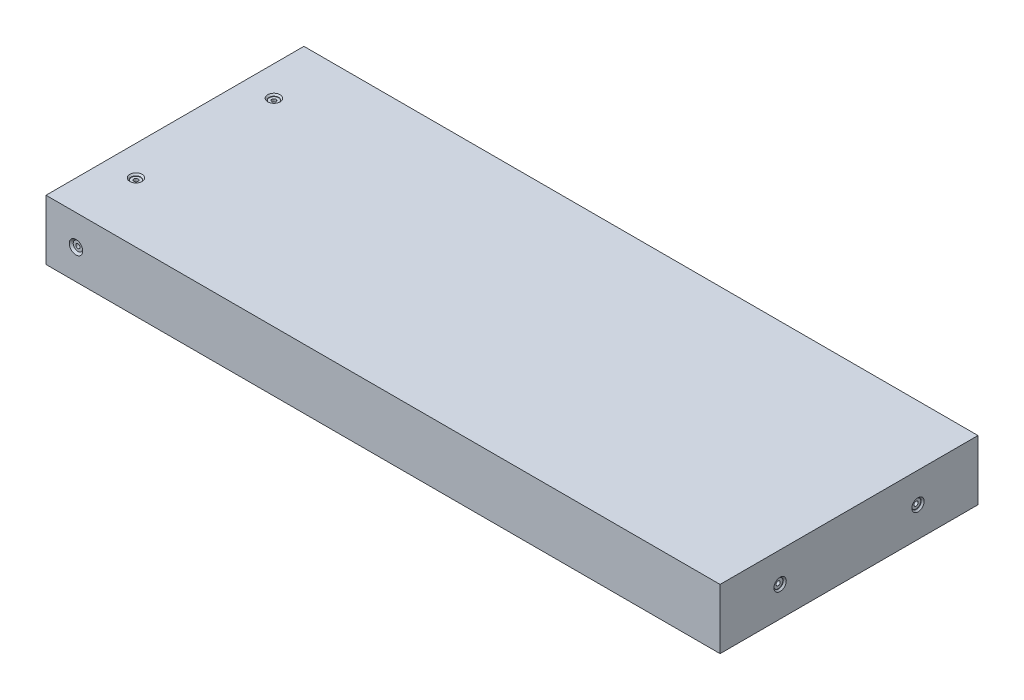
ISO-10303-21;
HEADER;
FILE_DESCRIPTION(('STEP AP214'),'2;1');
FILE_NAME('part.step','',(''),(''),'','','');
FILE_SCHEMA(('AUTOMOTIVE_DESIGN { 1 0 10303 214 1 1 1 1 }'));
ENDSEC;
DATA;
#1=APPLICATION_CONTEXT('core data for automotive mechanical design processes');
#2=APPLICATION_PROTOCOL_DEFINITION('international standard','automotive_design',2000,#1);
#3=PRODUCT_CONTEXT('',#1,'mechanical');
#4=PRODUCT('Part','Part','',(#3));
#5=PRODUCT_RELATED_PRODUCT_CATEGORY('part','',(#4));
#6=PRODUCT_DEFINITION_FORMATION('','',#4);
#7=PRODUCT_DEFINITION_CONTEXT('part definition',#1,'design');
#8=PRODUCT_DEFINITION('design','',#6,#7);
#9=PRODUCT_DEFINITION_SHAPE('','',#8);
#10=(LENGTH_UNIT() NAMED_UNIT(*) SI_UNIT(.MILLI.,.METRE.));
#11=(NAMED_UNIT(*) PLANE_ANGLE_UNIT() SI_UNIT($,.RADIAN.));
#12=(NAMED_UNIT(*) SI_UNIT($,.STERADIAN.) SOLID_ANGLE_UNIT());
#13=UNCERTAINTY_MEASURE_WITH_UNIT(LENGTH_MEASURE(1.E-05),#10,'distance_accuracy_value','');
#14=(GEOMETRIC_REPRESENTATION_CONTEXT(3) GLOBAL_UNCERTAINTY_ASSIGNED_CONTEXT((#13)) GLOBAL_UNIT_ASSIGNED_CONTEXT((#10,
#11,#12)) REPRESENTATION_CONTEXT('',''));
#15=CARTESIAN_POINT('',(0.,0.,0.));
#16=DIRECTION('',(0.,0.,1.));
#17=DIRECTION('',(1.,0.,0.));
#18=AXIS2_PLACEMENT_3D('',#15,#16,#17);
#19=CARTESIAN_POINT('',(-130.,12.7,-54.6));
#20=DIRECTION('',(0.,0.,-1.));
#21=DIRECTION('',(-1.,0.,0.));
#22=AXIS2_PLACEMENT_3D('',#19,#20,#21);
#23=CYLINDRICAL_SURFACE('',#22,0.889000000000001);
#24=CARTESIAN_POINT('',(-130.,12.7,-53.7872));
#25=DIRECTION('',(0.,0.,-1.));
#26=DIRECTION('',(-1.,0.,0.));
#27=AXIS2_PLACEMENT_3D('',#24,#25,#26);
#28=CIRCLE('',#27,0.889000000000001);
#29=CARTESIAN_POINT('',(-130.889,12.7,-53.7872));
#30=VERTEX_POINT('',#29);
#31=EDGE_CURVE('E167',#30,#30,#28,.T.);
#32=ORIENTED_EDGE('',*,*,#31,.T.);
#33=EDGE_LOOP('',(#32));
#34=FACE_BOUND('',#33,.T.);
#35=CARTESIAN_POINT('',(-130.,12.7,-29.1995));
#36=DIRECTION('',(0.,-0.707106781186547,-0.707106781186547));
#37=DIRECTION('',(0.,0.707106781186547,-0.707106781186547));
#38=AXIS2_PLACEMENT_3D('',#35,#36,#37);
#39=ELLIPSE('',#38,1.25723585694968,0.889000000000001);
#40=CARTESIAN_POINT('',(-129.111,12.7,-29.1995));
#41=VERTEX_POINT('',#40);
#42=CARTESIAN_POINT('',(-130.889,12.7,-29.1995));
#43=VERTEX_POINT('',#42);
#44=EDGE_CURVE('E45',#41,#43,#39,.F.);
#45=ORIENTED_EDGE('',*,*,#44,.T.);
#46=CARTESIAN_POINT('',(-130.,12.7,-29.1995));
#47=DIRECTION('',(0.,0.707106781186547,-0.707106781186547));
#48=DIRECTION('',(0.,-0.707106781186547,-0.707106781186547));
#49=AXIS2_PLACEMENT_3D('',#46,#47,#48);
#50=ELLIPSE('',#49,1.25723585694968,0.889000000000001);
#51=EDGE_CURVE('E11',#43,#41,#50,.F.);
#52=ORIENTED_EDGE('',*,*,#51,.T.);
#53=EDGE_LOOP('',(#45,#52));
#54=FACE_BOUND('',#53,.T.);
#55=ADVANCED_FACE('F32',(#34,#54),#23,.F.);
#56=CARTESIAN_POINT('',(-130.,12.7,54.6));
#57=DIRECTION('',(0.,0.,1.));
#58=DIRECTION('',(1.,0.,0.));
#59=AXIS2_PLACEMENT_3D('',#56,#57,#58);
#60=CYLINDRICAL_SURFACE('',#59,0.889000000000001);
#61=CARTESIAN_POINT('',(-130.,12.7,53.7872));
#62=DIRECTION('',(0.,0.,1.));
#63=DIRECTION('',(1.,0.,0.));
#64=AXIS2_PLACEMENT_3D('',#61,#62,#63);
#65=CIRCLE('',#64,0.889000000000001);
#66=CARTESIAN_POINT('',(-129.111,12.7,53.7872));
#67=VERTEX_POINT('',#66);
#68=EDGE_CURVE('E182',#67,#67,#65,.T.);
#69=ORIENTED_EDGE('',*,*,#68,.T.);
#70=EDGE_LOOP('',(#69));
#71=FACE_BOUND('',#70,.T.);
#72=CARTESIAN_POINT('',(-130.,12.7,29.2005));
#73=DIRECTION('',(0.,-0.707106781186547,0.707106781186547));
#74=DIRECTION('',(0.,0.707106781186547,0.707106781186547));
#75=AXIS2_PLACEMENT_3D('',#72,#73,#74);
#76=ELLIPSE('',#75,1.25723585694968,0.889000000000001);
#77=CARTESIAN_POINT('',(-130.889,12.7,29.2005));
#78=VERTEX_POINT('',#77);
#79=CARTESIAN_POINT('',(-129.111,12.7,29.2005));
#80=VERTEX_POINT('',#79);
#81=EDGE_CURVE('E52',#78,#80,#76,.F.);
#82=ORIENTED_EDGE('',*,*,#81,.T.);
#83=CARTESIAN_POINT('',(-130.,12.7,29.2005));
#84=DIRECTION('',(0.,0.707106781186547,0.707106781186547));
#85=DIRECTION('',(0.,-0.707106781186547,0.707106781186547));
#86=AXIS2_PLACEMENT_3D('',#83,#84,#85);
#87=ELLIPSE('',#86,1.25723585694968,0.889000000000001);
#88=EDGE_CURVE('E225',#80,#78,#87,.F.);
#89=ORIENTED_EDGE('',*,*,#88,.T.);
#90=EDGE_LOOP('',(#82,#89));
#91=FACE_BOUND('',#90,.T.);
#92=ADVANCED_FACE('F240',(#71,#91),#60,.F.);
#93=CARTESIAN_POINT('',(142.7,25.4,-54.6));
#94=DIRECTION('',(-1.,0.,0.));
#95=DIRECTION('',(0.,0.,1.));
#96=AXIS2_PLACEMENT_3D('',#93,#94,#95);
#97=PLANE('',#96);
#98=CARTESIAN_POINT('',(142.7,12.7,-29.2005));
#99=DIRECTION('',(1.,0.,0.));
#100=DIRECTION('',(0.,0.,-1.));
#101=AXIS2_PLACEMENT_3D('',#98,#99,#100);
#102=CIRCLE('',#101,2.62001);
#103=CARTESIAN_POINT('',(142.7,12.7,-31.82051));
#104=VERTEX_POINT('',#103);
#105=EDGE_CURVE('E590',#104,#104,#102,.T.);
#106=ORIENTED_EDGE('',*,*,#105,.F.);
#107=EDGE_LOOP('',(#106));
#108=FACE_BOUND('',#107,.T.);
#109=CARTESIAN_POINT('',(142.7,12.7,29.1995));
#110=DIRECTION('',(1.,0.,0.));
#111=DIRECTION('',(0.,0.,-1.));
#112=AXIS2_PLACEMENT_3D('',#109,#110,#111);
#113=CIRCLE('',#112,2.62001);
#114=CARTESIAN_POINT('',(142.7,12.7,26.57949));
#115=VERTEX_POINT('',#114);
#116=EDGE_CURVE('E143',#115,#115,#113,.T.);
#117=ORIENTED_EDGE('',*,*,#116,.F.);
#118=EDGE_LOOP('',(#117));
#119=FACE_BOUND('',#118,.T.);
#120=DIRECTION('',(0.,0.,-1.));
#121=VECTOR('',#120,1.);
#122=CARTESIAN_POINT('',(142.7,0.,-54.6));
#123=LINE('',#122,#121);
#124=CARTESIAN_POINT('',(142.7,0.,54.6));
#125=VERTEX_POINT('',#124);
#126=CARTESIAN_POINT('',(142.7,0.,-54.6));
#127=VERTEX_POINT('',#126);
#128=EDGE_CURVE('E188',#125,#127,#123,.T.);
#129=ORIENTED_EDGE('',*,*,#128,.T.);
#130=DIRECTION('',(0.,-1.,0.));
#131=VECTOR('',#130,1.);
#132=CARTESIAN_POINT('',(142.7,25.4,-54.6));
#133=LINE('',#132,#131);
#134=CARTESIAN_POINT('',(142.7,25.4,-54.6));
#135=VERTEX_POINT('',#134);
#136=EDGE_CURVE('E215',#135,#127,#133,.T.);
#137=ORIENTED_EDGE('',*,*,#136,.F.);
#138=DIRECTION('',(0.,0.,-1.));
#139=VECTOR('',#138,1.);
#140=CARTESIAN_POINT('',(142.7,25.4,-54.6));
#141=LINE('',#140,#139);
#142=CARTESIAN_POINT('',(142.7,25.4,54.6));
#143=VERTEX_POINT('',#142);
#144=EDGE_CURVE('E189',#143,#135,#141,.T.);
#145=ORIENTED_EDGE('',*,*,#144,.F.);
#146=DIRECTION('',(0.,-1.,0.));
#147=VECTOR('',#146,1.);
#148=CARTESIAN_POINT('',(142.7,25.4,54.6));
#149=LINE('',#148,#147);
#150=EDGE_CURVE('E199',#143,#125,#149,.T.);
#151=ORIENTED_EDGE('',*,*,#150,.T.);
#152=EDGE_LOOP('',(#129,#137,#145,#151));
#153=FACE_BOUND('',#152,.T.);
#154=ADVANCED_FACE('F34',(#108,#119,#153),#97,.F.);
#155=CARTESIAN_POINT('',(-142.7,25.4,-54.6));
#156=DIRECTION('',(0.,0.,1.));
#157=DIRECTION('',(1.,0.,0.));
#158=AXIS2_PLACEMENT_3D('',#155,#156,#157);
#159=PLANE('',#158);
#160=CARTESIAN_POINT('',(-130.,12.7,-54.6));
#161=DIRECTION('',(0.,0.,-1.));
#162=DIRECTION('',(-1.,0.,0.));
#163=AXIS2_PLACEMENT_3D('',#160,#161,#162);
#164=CIRCLE('',#163,2.85749999999998);
#165=CARTESIAN_POINT('',(-132.8575,12.7,-54.6));
#166=VERTEX_POINT('',#165);
#167=EDGE_CURVE('E158',#166,#166,#164,.T.);
#168=ORIENTED_EDGE('',*,*,#167,.F.);
#169=EDGE_LOOP('',(#168));
#170=FACE_BOUND('',#169,.T.);
#171=DIRECTION('',(-1.,0.,0.));
#172=VECTOR('',#171,1.);
#173=CARTESIAN_POINT('',(-142.7,0.,-54.6));
#174=LINE('',#173,#172);
#175=CARTESIAN_POINT('',(-142.7,0.,-54.6));
#176=VERTEX_POINT('',#175);
#177=EDGE_CURVE('E202',#127,#176,#174,.T.);
#178=ORIENTED_EDGE('',*,*,#177,.T.);
#179=DIRECTION('',(0.,-1.,0.));
#180=VECTOR('',#179,1.);
#181=CARTESIAN_POINT('',(-142.7,25.4,-54.6));
#182=LINE('',#181,#180);
#183=CARTESIAN_POINT('',(-142.7,25.4,-54.6));
#184=VERTEX_POINT('',#183);
#185=EDGE_CURVE('E212',#184,#176,#182,.T.);
#186=ORIENTED_EDGE('',*,*,#185,.F.);
#187=DIRECTION('',(-1.,0.,0.));
#188=VECTOR('',#187,1.);
#189=CARTESIAN_POINT('',(-142.7,25.4,-54.6));
#190=LINE('',#189,#188);
#191=EDGE_CURVE('E192',#135,#184,#190,.T.);
#192=ORIENTED_EDGE('',*,*,#191,.F.);
#193=ORIENTED_EDGE('',*,*,#136,.T.);
#194=EDGE_LOOP('',(#178,#186,#192,#193));
#195=FACE_BOUND('',#194,.T.);
#196=ADVANCED_FACE('F301',(#170,#195),#159,.F.);
#197=CARTESIAN_POINT('',(-142.7,25.4,-54.6));
#198=DIRECTION('',(1.,0.,0.));
#199=DIRECTION('',(0.,0.,-1.));
#200=AXIS2_PLACEMENT_3D('',#197,#198,#199);
#201=PLANE('',#200);
#202=DIRECTION('',(0.,0.,1.));
#203=VECTOR('',#202,1.);
#204=CARTESIAN_POINT('',(-142.7,0.,-54.6));
#205=LINE('',#204,#203);
#206=CARTESIAN_POINT('',(-142.7,0.,54.6));
#207=VERTEX_POINT('',#206);
#208=EDGE_CURVE('E204',#176,#207,#205,.T.);
#209=ORIENTED_EDGE('',*,*,#208,.T.);
#210=DIRECTION('',(0.,-1.,0.));
#211=VECTOR('',#210,1.);
#212=CARTESIAN_POINT('',(-142.7,25.4,54.6));
#213=LINE('',#212,#211);
#214=CARTESIAN_POINT('',(-142.7,25.4,54.6));
#215=VERTEX_POINT('',#214);
#216=EDGE_CURVE('E209',#215,#207,#213,.T.);
#217=ORIENTED_EDGE('',*,*,#216,.F.);
#218=DIRECTION('',(0.,0.,1.));
#219=VECTOR('',#218,1.);
#220=CARTESIAN_POINT('',(-142.7,25.4,-54.6));
#221=LINE('',#220,#219);
#222=EDGE_CURVE('E195',#184,#215,#221,.T.);
#223=ORIENTED_EDGE('',*,*,#222,.F.);
#224=ORIENTED_EDGE('',*,*,#185,.T.);
#225=EDGE_LOOP('',(#209,#217,#223,#224));
#226=FACE_BOUND('',#225,.T.);
#227=ADVANCED_FACE('F298',(#226),#201,.F.);
#228=CARTESIAN_POINT('',(-142.7,25.4,54.6));
#229=DIRECTION('',(0.,0.,-1.));
#230=DIRECTION('',(-1.,0.,0.));
#231=AXIS2_PLACEMENT_3D('',#228,#229,#230);
#232=PLANE('',#231);
#233=CARTESIAN_POINT('',(-130.,12.7,54.6));
#234=DIRECTION('',(0.,0.,1.));
#235=DIRECTION('',(1.,0.,0.));
#236=AXIS2_PLACEMENT_3D('',#233,#234,#235);
#237=CIRCLE('',#236,2.85749999999998);
#238=CARTESIAN_POINT('',(-127.1425,12.7,54.6));
#239=VERTEX_POINT('',#238);
#240=EDGE_CURVE('E173',#239,#239,#237,.T.);
#241=ORIENTED_EDGE('',*,*,#240,.F.);
#242=EDGE_LOOP('',(#241));
#243=FACE_BOUND('',#242,.T.);
#244=DIRECTION('',(1.,0.,0.));
#245=VECTOR('',#244,1.);
#246=CARTESIAN_POINT('',(-142.7,0.,54.6));
#247=LINE('',#246,#245);
#248=EDGE_CURVE('E193',#207,#125,#247,.T.);
#249=ORIENTED_EDGE('',*,*,#248,.T.);
#250=ORIENTED_EDGE('',*,*,#150,.F.);
#251=DIRECTION('',(1.,0.,0.));
#252=VECTOR('',#251,1.);
#253=CARTESIAN_POINT('',(-142.7,25.4,54.6));
#254=LINE('',#253,#252);
#255=EDGE_CURVE('E197',#215,#143,#254,.T.);
#256=ORIENTED_EDGE('',*,*,#255,.F.);
#257=ORIENTED_EDGE('',*,*,#216,.T.);
#258=EDGE_LOOP('',(#249,#250,#256,#257));
#259=FACE_BOUND('',#258,.T.);
#260=ADVANCED_FACE('F291',(#243,#259),#232,.F.);
#261=CARTESIAN_POINT('',(0.,25.4,0.));
#262=DIRECTION('',(0.,1.,0.));
#263=DIRECTION('',(0.,0.,1.));
#264=AXIS2_PLACEMENT_3D('',#261,#262,#263);
#265=PLANE('',#264);
#266=CARTESIAN_POINT('',(-130.,25.4,-29.1995));
#267=DIRECTION('',(0.,1.,0.));
#268=DIRECTION('',(0.,0.,1.));
#269=AXIS2_PLACEMENT_3D('',#266,#267,#268);
#270=CIRCLE('',#269,2.62001000000001);
#271=CARTESIAN_POINT('',(-130.,25.4,-26.57949));
#272=VERTEX_POINT('',#271);
#273=EDGE_CURVE('E106',#272,#272,#270,.T.);
#274=ORIENTED_EDGE('',*,*,#273,.F.);
#275=EDGE_LOOP('',(#274));
#276=FACE_BOUND('',#275,.T.);
#277=CARTESIAN_POINT('',(-130.,25.4,29.2005));
#278=DIRECTION('',(0.,1.,0.));
#279=DIRECTION('',(0.,0.,1.));
#280=AXIS2_PLACEMENT_3D('',#277,#278,#279);
#281=CIRCLE('',#280,2.62001000000001);
#282=CARTESIAN_POINT('',(-130.,25.4,31.82051));
#283=VERTEX_POINT('',#282);
#284=EDGE_CURVE('E128',#283,#283,#281,.T.);
#285=ORIENTED_EDGE('',*,*,#284,.F.);
#286=EDGE_LOOP('',(#285));
#287=FACE_BOUND('',#286,.T.);
#288=ORIENTED_EDGE('',*,*,#144,.T.);
#289=ORIENTED_EDGE('',*,*,#191,.T.);
#290=ORIENTED_EDGE('',*,*,#222,.T.);
#291=ORIENTED_EDGE('',*,*,#255,.T.);
#292=EDGE_LOOP('',(#288,#289,#290,#291));
#293=FACE_BOUND('',#292,.T.);
#294=ADVANCED_FACE('F288',(#276,#287,#293),#265,.T.);
#295=CARTESIAN_POINT('',(0.,0.,0.));
#296=DIRECTION('',(0.,1.,0.));
#297=DIRECTION('',(0.,0.,1.));
#298=AXIS2_PLACEMENT_3D('',#295,#296,#297);
#299=PLANE('',#298);
#300=CARTESIAN_POINT('',(-130.,0.,-29.1995));
#301=DIRECTION('',(0.,1.,0.));
#302=DIRECTION('',(0.,0.,1.));
#303=AXIS2_PLACEMENT_3D('',#300,#301,#302);
#304=CIRCLE('',#303,0.889000000000001);
#305=CARTESIAN_POINT('',(-130.,0.,-28.3105));
#306=VERTEX_POINT('',#305);
#307=EDGE_CURVE('E125',#306,#306,#304,.T.);
#308=ORIENTED_EDGE('',*,*,#307,.T.);
#309=EDGE_LOOP('',(#308));
#310=FACE_BOUND('',#309,.T.);
#311=CARTESIAN_POINT('',(-130.,0.,29.2005));
#312=DIRECTION('',(0.,1.,0.));
#313=DIRECTION('',(0.,0.,1.));
#314=AXIS2_PLACEMENT_3D('',#311,#312,#313);
#315=CIRCLE('',#314,0.889000000000001);
#316=CARTESIAN_POINT('',(-130.,0.,30.0895));
#317=VERTEX_POINT('',#316);
#318=EDGE_CURVE('E140',#317,#317,#315,.T.);
#319=ORIENTED_EDGE('',*,*,#318,.T.);
#320=EDGE_LOOP('',(#319));
#321=FACE_BOUND('',#320,.T.);
#322=ORIENTED_EDGE('',*,*,#128,.F.);
#323=ORIENTED_EDGE('',*,*,#248,.F.);
#324=ORIENTED_EDGE('',*,*,#208,.F.);
#325=ORIENTED_EDGE('',*,*,#177,.F.);
#326=EDGE_LOOP('',(#322,#323,#324,#325));
#327=FACE_BOUND('',#326,.T.);
#328=ADVANCED_FACE('F277',(#310,#321,#327),#299,.F.);
#329=CARTESIAN_POINT('',(-129.111,12.7,53.7872));
#330=DIRECTION('',(0.,0.,-1.));
#331=DIRECTION('',(-1.,0.,0.));
#332=AXIS2_PLACEMENT_3D('',#329,#330,#331);
#333=PLANE('',#332);
#334=ORIENTED_EDGE('',*,*,#68,.F.);
#335=EDGE_LOOP('',(#334));
#336=FACE_BOUND('',#335,.T.);
#337=CARTESIAN_POINT('',(-130.,12.7,53.7872));
#338=DIRECTION('',(0.,0.,1.));
#339=DIRECTION('',(1.,0.,0.));
#340=AXIS2_PLACEMENT_3D('',#337,#338,#339);
#341=CIRCLE('',#340,1.98500999999998);
#342=CARTESIAN_POINT('',(-128.01499,12.7,53.7872));
#343=VERTEX_POINT('',#342);
#344=EDGE_CURVE('E179',#343,#343,#341,.T.);
#345=ORIENTED_EDGE('',*,*,#344,.T.);
#346=EDGE_LOOP('',(#345));
#347=FACE_BOUND('',#346,.T.);
#348=ADVANCED_FACE('F274',(#336,#347),#333,.F.);
#349=CARTESIAN_POINT('',(-130.,12.7,54.6));
#350=DIRECTION('',(0.,0.,1.));
#351=DIRECTION('',(1.,0.,0.));
#352=AXIS2_PLACEMENT_3D('',#349,#350,#351);
#353=CYLINDRICAL_SURFACE('',#352,1.98500999999998);
#354=ORIENTED_EDGE('',*,*,#344,.F.);
#355=EDGE_LOOP('',(#354));
#356=FACE_BOUND('',#355,.T.);
#357=CARTESIAN_POINT('',(-130.,12.7,53.72751));
#358=DIRECTION('',(0.,0.,1.));
#359=DIRECTION('',(1.,0.,0.));
#360=AXIS2_PLACEMENT_3D('',#357,#358,#359);
#361=CIRCLE('',#360,1.98500999999998);
#362=CARTESIAN_POINT('',(-128.01499,12.7,53.72751));
#363=VERTEX_POINT('',#362);
#364=EDGE_CURVE('E176',#363,#363,#361,.T.);
#365=ORIENTED_EDGE('',*,*,#364,.T.);
#366=EDGE_LOOP('',(#365));
#367=FACE_BOUND('',#366,.T.);
#368=ADVANCED_FACE('F270',(#356,#367),#353,.T.);
#369=CARTESIAN_POINT('',(-130.,12.7,54.6));
#370=DIRECTION('',(0.,0.,1.));
#371=DIRECTION('',(1.,0.,0.));
#372=AXIS2_PLACEMENT_3D('',#369,#370,#371);
#373=CONICAL_SURFACE('',#372,2.85749999999998,0.785398163397448);
#374=ORIENTED_EDGE('',*,*,#364,.F.);
#375=EDGE_LOOP('',(#374));
#376=FACE_BOUND('',#375,.T.);
#377=ORIENTED_EDGE('',*,*,#240,.T.);
#378=EDGE_LOOP('',(#377));
#379=FACE_BOUND('',#378,.T.);
#380=ADVANCED_FACE('F266',(#376,#379),#373,.F.);
#381=CARTESIAN_POINT('',(-129.111,12.7,-53.7872));
#382=DIRECTION('',(0.,0.,1.));
#383=DIRECTION('',(1.,0.,0.));
#384=AXIS2_PLACEMENT_3D('',#381,#382,#383);
#385=PLANE('',#384);
#386=ORIENTED_EDGE('',*,*,#31,.F.);
#387=EDGE_LOOP('',(#386));
#388=FACE_BOUND('',#387,.T.);
#389=CARTESIAN_POINT('',(-130.,12.7,-53.7872));
#390=DIRECTION('',(0.,0.,-1.));
#391=DIRECTION('',(-1.,0.,0.));
#392=AXIS2_PLACEMENT_3D('',#389,#390,#391);
#393=CIRCLE('',#392,1.98500999999998);
#394=CARTESIAN_POINT('',(-131.98501,12.7,-53.7872));
#395=VERTEX_POINT('',#394);
#396=EDGE_CURVE('E164',#395,#395,#393,.T.);
#397=ORIENTED_EDGE('',*,*,#396,.T.);
#398=EDGE_LOOP('',(#397));
#399=FACE_BOUND('',#398,.T.);
#400=ADVANCED_FACE('F269',(#388,#399),#385,.F.);
#401=CARTESIAN_POINT('',(-130.,12.7,-54.6));
#402=DIRECTION('',(0.,0.,-1.));
#403=DIRECTION('',(-1.,0.,0.));
#404=AXIS2_PLACEMENT_3D('',#401,#402,#403);
#405=CYLINDRICAL_SURFACE('',#404,1.98500999999998);
#406=ORIENTED_EDGE('',*,*,#396,.F.);
#407=EDGE_LOOP('',(#406));
#408=FACE_BOUND('',#407,.T.);
#409=CARTESIAN_POINT('',(-130.,12.7,-53.72751));
#410=DIRECTION('',(0.,0.,-1.));
#411=DIRECTION('',(-1.,0.,0.));
#412=AXIS2_PLACEMENT_3D('',#409,#410,#411);
#413=CIRCLE('',#412,1.98500999999998);
#414=CARTESIAN_POINT('',(-131.98501,12.7,-53.72751));
#415=VERTEX_POINT('',#414);
#416=EDGE_CURVE('E161',#415,#415,#413,.T.);
#417=ORIENTED_EDGE('',*,*,#416,.T.);
#418=EDGE_LOOP('',(#417));
#419=FACE_BOUND('',#418,.T.);
#420=ADVANCED_FACE('F329',(#408,#419),#405,.T.);
#421=CARTESIAN_POINT('',(-130.,12.7,-54.6));
#422=DIRECTION('',(0.,0.,-1.));
#423=DIRECTION('',(-1.,0.,0.));
#424=AXIS2_PLACEMENT_3D('',#421,#422,#423);
#425=CONICAL_SURFACE('',#424,2.85749999999998,0.785398163397448);
#426=ORIENTED_EDGE('',*,*,#416,.F.);
#427=EDGE_LOOP('',(#426));
#428=FACE_BOUND('',#427,.T.);
#429=ORIENTED_EDGE('',*,*,#167,.T.);
#430=EDGE_LOOP('',(#429));
#431=FACE_BOUND('',#430,.T.);
#432=ADVANCED_FACE('F326',(#428,#431),#425,.F.);
#433=CARTESIAN_POINT('',(112.7,12.7,29.1995));
#434=DIRECTION('',(1.,0.,0.));
#435=DIRECTION('',(0.,0.,-1.));
#436=AXIS2_PLACEMENT_3D('',#433,#434,#435);
#437=CONICAL_SURFACE('',#436,0.888999999999992,1.02974425867664);
#438=CARTESIAN_POINT('',(112.165834909685,12.7,29.1995));
#439=VERTEX_POINT('',#438);
#440=VERTEX_LOOP('',#439);
#441=FACE_BOUND('',#440,.T.);
#442=CARTESIAN_POINT('',(112.7,12.7,29.1995));
#443=DIRECTION('',(1.,0.,0.));
#444=DIRECTION('',(0.,0.,-1.));
#445=AXIS2_PLACEMENT_3D('',#442,#443,#444);
#446=CIRCLE('',#445,0.888999999999992);
#447=CARTESIAN_POINT('',(112.7,12.7,28.3105));
#448=VERTEX_POINT('',#447);
#449=EDGE_CURVE('E155',#448,#448,#446,.T.);
#450=ORIENTED_EDGE('',*,*,#449,.T.);
#451=EDGE_LOOP('',(#450));
#452=FACE_BOUND('',#451,.T.);
#453=ADVANCED_FACE('F328',(#441,#452),#437,.F.);
#454=CARTESIAN_POINT('',(142.7,12.7,29.1995));
#455=DIRECTION('',(1.,0.,0.));
#456=DIRECTION('',(0.,0.,-1.));
#457=AXIS2_PLACEMENT_3D('',#454,#455,#456);
#458=CYLINDRICAL_SURFACE('',#457,0.888999999999994);
#459=ORIENTED_EDGE('',*,*,#449,.F.);
#460=EDGE_LOOP('',(#459));
#461=FACE_BOUND('',#460,.T.);
#462=CARTESIAN_POINT('',(141.8872,12.7,29.1995));
#463=DIRECTION('',(1.,0.,0.));
#464=DIRECTION('',(0.,0.,-1.));
#465=AXIS2_PLACEMENT_3D('',#462,#463,#464);
#466=CIRCLE('',#465,0.888999999999996);
#467=CARTESIAN_POINT('',(141.8872,12.7,28.3105));
#468=VERTEX_POINT('',#467);
#469=EDGE_CURVE('E152',#468,#468,#466,.T.);
#470=ORIENTED_EDGE('',*,*,#469,.T.);
#471=EDGE_LOOP('',(#470));
#472=FACE_BOUND('',#471,.T.);
#473=ADVANCED_FACE('F336',(#461,#472),#458,.F.);
#474=CARTESIAN_POINT('',(141.8872,13.589,29.1995));
#475=DIRECTION('',(-1.,0.,0.));
#476=DIRECTION('',(0.,0.,1.));
#477=AXIS2_PLACEMENT_3D('',#474,#475,#476);
#478=PLANE('',#477);
#479=ORIENTED_EDGE('',*,*,#469,.F.);
#480=EDGE_LOOP('',(#479));
#481=FACE_BOUND('',#480,.T.);
#482=CARTESIAN_POINT('',(141.8872,12.7,29.1995));
#483=DIRECTION('',(1.,0.,0.));
#484=DIRECTION('',(0.,0.,-1.));
#485=AXIS2_PLACEMENT_3D('',#482,#483,#484);
#486=CIRCLE('',#485,1.98501);
#487=CARTESIAN_POINT('',(141.8872,12.7,27.21449));
#488=VERTEX_POINT('',#487);
#489=EDGE_CURVE('E149',#488,#488,#486,.T.);
#490=ORIENTED_EDGE('',*,*,#489,.T.);
#491=EDGE_LOOP('',(#490));
#492=FACE_BOUND('',#491,.T.);
#493=ADVANCED_FACE('F376',(#481,#492),#478,.F.);
#494=CARTESIAN_POINT('',(142.7,12.7,29.1995));
#495=DIRECTION('',(1.,0.,0.));
#496=DIRECTION('',(0.,0.,-1.));
#497=AXIS2_PLACEMENT_3D('',#494,#495,#496);
#498=CYLINDRICAL_SURFACE('',#497,1.98501);
#499=ORIENTED_EDGE('',*,*,#489,.F.);
#500=EDGE_LOOP('',(#499));
#501=FACE_BOUND('',#500,.T.);
#502=CARTESIAN_POINT('',(142.065,12.7,29.1995));
#503=DIRECTION('',(1.,0.,0.));
#504=DIRECTION('',(0.,0.,-1.));
#505=AXIS2_PLACEMENT_3D('',#502,#503,#504);
#506=CIRCLE('',#505,1.98501);
#507=CARTESIAN_POINT('',(142.065,12.7,27.21449));
#508=VERTEX_POINT('',#507);
#509=EDGE_CURVE('E146',#508,#508,#506,.T.);
#510=ORIENTED_EDGE('',*,*,#509,.T.);
#511=EDGE_LOOP('',(#510));
#512=FACE_BOUND('',#511,.T.);
#513=ADVANCED_FACE('F385',(#501,#512),#498,.F.);
#514=CARTESIAN_POINT('',(142.7,12.7,29.1995));
#515=DIRECTION('',(1.,0.,0.));
#516=DIRECTION('',(0.,0.,-1.));
#517=AXIS2_PLACEMENT_3D('',#514,#515,#516);
#518=CONICAL_SURFACE('',#517,2.62001,0.785398163397451);
#519=ORIENTED_EDGE('',*,*,#509,.F.);
#520=EDGE_LOOP('',(#519));
#521=FACE_BOUND('',#520,.T.);
#522=ORIENTED_EDGE('',*,*,#116,.T.);
#523=EDGE_LOOP('',(#522));
#524=FACE_BOUND('',#523,.T.);
#525=ADVANCED_FACE('F395',(#521,#524),#518,.F.);
#526=CARTESIAN_POINT('',(-129.111,24.5872,29.2005));
#527=DIRECTION('',(0.,-1.,0.));
#528=DIRECTION('',(0.,0.,-1.));
#529=AXIS2_PLACEMENT_3D('',#526,#527,#528);
#530=PLANE('',#529);
#531=CARTESIAN_POINT('',(-130.,24.5872,29.2005));
#532=DIRECTION('',(0.,1.,0.));
#533=DIRECTION('',(0.,0.,1.));
#534=AXIS2_PLACEMENT_3D('',#531,#532,#533);
#535=CIRCLE('',#534,0.889000000000001);
#536=CARTESIAN_POINT('',(-130.,24.5872,30.0895));
#537=VERTEX_POINT('',#536);
#538=EDGE_CURVE('E137',#537,#537,#535,.T.);
#539=ORIENTED_EDGE('',*,*,#538,.F.);
#540=EDGE_LOOP('',(#539));
#541=FACE_BOUND('',#540,.T.);
#542=CARTESIAN_POINT('',(-130.,24.5872,29.2005));
#543=DIRECTION('',(0.,1.,0.));
#544=DIRECTION('',(0.,0.,1.));
#545=AXIS2_PLACEMENT_3D('',#542,#543,#544);
#546=CIRCLE('',#545,1.98500999999998);
#547=CARTESIAN_POINT('',(-130.,24.5872,31.18551));
#548=VERTEX_POINT('',#547);
#549=EDGE_CURVE('E134',#548,#548,#546,.T.);
#550=ORIENTED_EDGE('',*,*,#549,.T.);
#551=EDGE_LOOP('',(#550));
#552=FACE_BOUND('',#551,.T.);
#553=ADVANCED_FACE('F404',(#541,#552),#530,.F.);
#554=CARTESIAN_POINT('',(-130.,25.4,29.2005));
#555=DIRECTION('',(0.,1.,0.));
#556=DIRECTION('',(0.,0.,1.));
#557=AXIS2_PLACEMENT_3D('',#554,#555,#556);
#558=CYLINDRICAL_SURFACE('',#557,0.889000000000001);
#559=ORIENTED_EDGE('',*,*,#538,.T.);
#560=EDGE_LOOP('',(#559));
#561=FACE_BOUND('',#560,.T.);
#562=ORIENTED_EDGE('',*,*,#81,.F.);
#563=CARTESIAN_POINT('',(-130.,12.7,29.2005));
#564=DIRECTION('',(0.,0.707106781186547,0.707106781186547));
#565=DIRECTION('',(0.,-0.707106781186547,0.707106781186547));
#566=AXIS2_PLACEMENT_3D('',#563,#564,#565);
#567=ELLIPSE('',#566,1.25723585694968,0.889000000000001);
#568=EDGE_CURVE('E222',#80,#78,#567,.T.);
#569=ORIENTED_EDGE('',*,*,#568,.F.);
#570=EDGE_LOOP('',(#562,#569));
#571=FACE_BOUND('',#570,.T.);
#572=ADVANCED_FACE('F439',(#561,#571),#558,.F.);
#573=CARTESIAN_POINT('',(-130.,25.4,29.2005));
#574=DIRECTION('',(0.,1.,0.));
#575=DIRECTION('',(0.,0.,1.));
#576=AXIS2_PLACEMENT_3D('',#573,#574,#575);
#577=CYLINDRICAL_SURFACE('',#576,1.98500999999998);
#578=ORIENTED_EDGE('',*,*,#549,.F.);
#579=EDGE_LOOP('',(#578));
#580=FACE_BOUND('',#579,.T.);
#581=CARTESIAN_POINT('',(-130.,24.765,29.2005));
#582=DIRECTION('',(0.,1.,0.));
#583=DIRECTION('',(0.,0.,1.));
#584=AXIS2_PLACEMENT_3D('',#581,#582,#583);
#585=CIRCLE('',#584,1.98500999999998);
#586=CARTESIAN_POINT('',(-130.,24.765,31.18551));
#587=VERTEX_POINT('',#586);
#588=EDGE_CURVE('E131',#587,#587,#585,.T.);
#589=ORIENTED_EDGE('',*,*,#588,.T.);
#590=EDGE_LOOP('',(#589));
#591=FACE_BOUND('',#590,.T.);
#592=ADVANCED_FACE('F449',(#580,#591),#577,.F.);
#593=CARTESIAN_POINT('',(-130.,25.4,29.2005));
#594=DIRECTION('',(0.,1.,0.));
#595=DIRECTION('',(0.,0.,1.));
#596=AXIS2_PLACEMENT_3D('',#593,#594,#595);
#597=CONICAL_SURFACE('',#596,2.62001000000001,0.78539816339747);
#598=ORIENTED_EDGE('',*,*,#588,.F.);
#599=EDGE_LOOP('',(#598));
#600=FACE_BOUND('',#599,.T.);
#601=ORIENTED_EDGE('',*,*,#284,.T.);
#602=EDGE_LOOP('',(#601));
#603=FACE_BOUND('',#602,.T.);
#604=ADVANCED_FACE('F286',(#600,#603),#597,.F.);
#605=CARTESIAN_POINT('',(-130.,12.7,24.6));
#606=DIRECTION('',(0.,0.,1.));
#607=DIRECTION('',(1.,0.,0.));
#608=AXIS2_PLACEMENT_3D('',#605,#606,#607);
#609=CONICAL_SURFACE('',#608,0.889000000000001,1.02974425867665);
#610=CARTESIAN_POINT('',(-130.,12.7,24.0658349096845));
#611=VERTEX_POINT('',#610);
#612=VERTEX_LOOP('',#611);
#613=FACE_BOUND('',#612,.T.);
#614=CARTESIAN_POINT('',(-130.,12.7,24.6));
#615=DIRECTION('',(0.,0.,1.));
#616=DIRECTION('',(1.,0.,0.));
#617=AXIS2_PLACEMENT_3D('',#614,#615,#616);
#618=CIRCLE('',#617,0.889000000000001);
#619=CARTESIAN_POINT('',(-129.111,12.7,24.6));
#620=VERTEX_POINT('',#619);
#621=EDGE_CURVE('E185',#620,#620,#618,.T.);
#622=ORIENTED_EDGE('',*,*,#621,.T.);
#623=EDGE_LOOP('',(#622));
#624=FACE_BOUND('',#623,.T.);
#625=ADVANCED_FACE('F282',(#613,#624),#609,.F.);
#626=CARTESIAN_POINT('',(-130.,12.7,29.2005));
#627=DIRECTION('',(0.,-0.707106781186547,0.707106781186547));
#628=DIRECTION('',(0.,0.707106781186547,0.707106781186547));
#629=AXIS2_PLACEMENT_3D('',#626,#627,#628);
#630=ELLIPSE('',#629,1.25723585694968,0.889000000000001);
#631=EDGE_CURVE('E219',#78,#80,#630,.T.);
#632=ORIENTED_EDGE('',*,*,#631,.T.);
#633=ORIENTED_EDGE('',*,*,#568,.T.);
#634=EDGE_LOOP('',(#632,#633));
#635=FACE_BOUND('',#634,.T.);
#636=ORIENTED_EDGE('',*,*,#621,.F.);
#637=EDGE_LOOP('',(#636));
#638=FACE_BOUND('',#637,.T.);
#639=ADVANCED_FACE('F248',(#635,#638),#60,.F.);
#640=ORIENTED_EDGE('',*,*,#631,.F.);
#641=ORIENTED_EDGE('',*,*,#88,.F.);
#642=EDGE_LOOP('',(#640,#641));
#643=FACE_BOUND('',#642,.T.);
#644=ORIENTED_EDGE('',*,*,#318,.F.);
#645=EDGE_LOOP('',(#644));
#646=FACE_BOUND('',#645,.T.);
#647=ADVANCED_FACE('F281',(#643,#646),#558,.F.);
#648=CARTESIAN_POINT('',(-130.,25.4,-29.1995));
#649=DIRECTION('',(0.,1.,0.));
#650=DIRECTION('',(0.,0.,1.));
#651=AXIS2_PLACEMENT_3D('',#648,#649,#650);
#652=CONICAL_SURFACE('',#651,2.62001000000001,0.78539816339747);
#653=CARTESIAN_POINT('',(-130.,24.765,-29.1995));
#654=DIRECTION('',(0.,1.,0.));
#655=DIRECTION('',(0.,0.,1.));
#656=AXIS2_PLACEMENT_3D('',#653,#654,#655);
#657=CIRCLE('',#656,1.98500999999998);
#658=CARTESIAN_POINT('',(-130.,24.765,-27.21449));
#659=VERTEX_POINT('',#658);
#660=EDGE_CURVE('E110',#659,#659,#657,.T.);
#661=ORIENTED_EDGE('',*,*,#660,.F.);
#662=EDGE_LOOP('',(#661));
#663=FACE_BOUND('',#662,.T.);
#664=ORIENTED_EDGE('',*,*,#273,.T.);
#665=EDGE_LOOP('',(#664));
#666=FACE_BOUND('',#665,.T.);
#667=ADVANCED_FACE('F484',(#663,#666),#652,.F.);
#668=CARTESIAN_POINT('',(-130.,25.4,-29.1995));
#669=DIRECTION('',(0.,1.,0.));
#670=DIRECTION('',(0.,0.,1.));
#671=AXIS2_PLACEMENT_3D('',#668,#669,#670);
#672=CYLINDRICAL_SURFACE('',#671,1.98500999999998);
#673=CARTESIAN_POINT('',(-130.,24.5872,-29.1995));
#674=DIRECTION('',(0.,1.,0.));
#675=DIRECTION('',(0.,0.,1.));
#676=AXIS2_PLACEMENT_3D('',#673,#674,#675);
#677=CIRCLE('',#676,1.98500999999998);
#678=CARTESIAN_POINT('',(-130.,24.5872,-27.21449));
#679=VERTEX_POINT('',#678);
#680=EDGE_CURVE('E119',#679,#679,#677,.T.);
#681=ORIENTED_EDGE('',*,*,#680,.F.);
#682=EDGE_LOOP('',(#681));
#683=FACE_BOUND('',#682,.T.);
#684=ORIENTED_EDGE('',*,*,#660,.T.);
#685=EDGE_LOOP('',(#684));
#686=FACE_BOUND('',#685,.T.);
#687=ADVANCED_FACE('F493',(#683,#686),#672,.F.);
#688=CARTESIAN_POINT('',(-129.111,24.5872,-29.1995));
#689=DIRECTION('',(0.,-1.,0.));
#690=DIRECTION('',(0.,0.,-1.));
#691=AXIS2_PLACEMENT_3D('',#688,#689,#690);
#692=PLANE('',#691);
#693=CARTESIAN_POINT('',(-130.,24.5872,-29.1995));
#694=DIRECTION('',(0.,1.,0.));
#695=DIRECTION('',(0.,0.,1.));
#696=AXIS2_PLACEMENT_3D('',#693,#694,#695);
#697=CIRCLE('',#696,0.889000000000001);
#698=CARTESIAN_POINT('',(-130.,24.5872,-28.3105));
#699=VERTEX_POINT('',#698);
#700=EDGE_CURVE('E122',#699,#699,#697,.T.);
#701=ORIENTED_EDGE('',*,*,#700,.F.);
#702=EDGE_LOOP('',(#701));
#703=FACE_BOUND('',#702,.T.);
#704=ORIENTED_EDGE('',*,*,#680,.T.);
#705=EDGE_LOOP('',(#704));
#706=FACE_BOUND('',#705,.T.);
#707=ADVANCED_FACE('F262',(#703,#706),#692,.F.);
#708=CARTESIAN_POINT('',(-130.,25.4,-29.1995));
#709=DIRECTION('',(0.,1.,0.));
#710=DIRECTION('',(0.,0.,1.));
#711=AXIS2_PLACEMENT_3D('',#708,#709,#710);
#712=CYLINDRICAL_SURFACE('',#711,0.889000000000001);
#713=ORIENTED_EDGE('',*,*,#700,.T.);
#714=EDGE_LOOP('',(#713));
#715=FACE_BOUND('',#714,.T.);
#716=ORIENTED_EDGE('',*,*,#44,.F.);
#717=CARTESIAN_POINT('',(-130.,12.7,-29.1995));
#718=DIRECTION('',(0.,0.707106781186547,-0.707106781186547));
#719=DIRECTION('',(0.,-0.707106781186547,-0.707106781186547));
#720=AXIS2_PLACEMENT_3D('',#717,#718,#719);
#721=ELLIPSE('',#720,1.25723585694968,0.889000000000001);
#722=EDGE_CURVE('E40',#43,#41,#721,.T.);
#723=ORIENTED_EDGE('',*,*,#722,.F.);
#724=EDGE_LOOP('',(#716,#723));
#725=FACE_BOUND('',#724,.T.);
#726=ADVANCED_FACE('F236',(#715,#725),#712,.F.);
#727=CARTESIAN_POINT('',(-130.,12.7,-24.6));
#728=DIRECTION('',(0.,0.,-1.));
#729=DIRECTION('',(-1.,0.,0.));
#730=AXIS2_PLACEMENT_3D('',#727,#728,#729);
#731=CONICAL_SURFACE('',#730,0.889000000000001,1.02974425867665);
#732=CARTESIAN_POINT('',(-130.,12.7,-24.0658349096845));
#733=VERTEX_POINT('',#732);
#734=VERTEX_LOOP('',#733);
#735=FACE_BOUND('',#734,.T.);
#736=CARTESIAN_POINT('',(-130.,12.7,-24.6));
#737=DIRECTION('',(0.,0.,-1.));
#738=DIRECTION('',(-1.,0.,0.));
#739=AXIS2_PLACEMENT_3D('',#736,#737,#738);
#740=CIRCLE('',#739,0.889000000000001);
#741=CARTESIAN_POINT('',(-130.889,12.7,-24.6));
#742=VERTEX_POINT('',#741);
#743=EDGE_CURVE('E170',#742,#742,#740,.T.);
#744=ORIENTED_EDGE('',*,*,#743,.T.);
#745=EDGE_LOOP('',(#744));
#746=FACE_BOUND('',#745,.T.);
#747=ADVANCED_FACE('F252',(#735,#746),#731,.F.);
#748=CARTESIAN_POINT('',(-130.,12.7,-29.1995));
#749=DIRECTION('',(0.,-0.707106781186547,-0.707106781186547));
#750=DIRECTION('',(0.,0.707106781186547,-0.707106781186547));
#751=AXIS2_PLACEMENT_3D('',#748,#749,#750);
#752=ELLIPSE('',#751,1.25723585694968,0.889000000000001);
#753=EDGE_CURVE('E228',#41,#43,#752,.T.);
#754=ORIENTED_EDGE('',*,*,#753,.T.);
#755=ORIENTED_EDGE('',*,*,#722,.T.);
#756=EDGE_LOOP('',(#754,#755));
#757=FACE_BOUND('',#756,.T.);
#758=ORIENTED_EDGE('',*,*,#743,.F.);
#759=EDGE_LOOP('',(#758));
#760=FACE_BOUND('',#759,.T.);
#761=ADVANCED_FACE('F232',(#757,#760),#23,.F.);
#762=ORIENTED_EDGE('',*,*,#753,.F.);
#763=ORIENTED_EDGE('',*,*,#51,.F.);
#764=EDGE_LOOP('',(#762,#763));
#765=FACE_BOUND('',#764,.T.);
#766=ORIENTED_EDGE('',*,*,#307,.F.);
#767=EDGE_LOOP('',(#766));
#768=FACE_BOUND('',#767,.T.);
#769=ADVANCED_FACE('F100',(#765,#768),#712,.F.);
#770=CARTESIAN_POINT('',(112.7,12.7,-29.2005));
#771=DIRECTION('',(1.,0.,0.));
#772=DIRECTION('',(0.,0.,-1.));
#773=AXIS2_PLACEMENT_3D('',#770,#771,#772);
#774=CONICAL_SURFACE('',#773,0.888999999999992,1.02974425867664);
#775=CARTESIAN_POINT('',(112.165834909685,12.7,-29.2005));
#776=VERTEX_POINT('',#775);
#777=VERTEX_LOOP('',#776);
#778=FACE_BOUND('',#777,.T.);
#779=CARTESIAN_POINT('',(112.7,12.7,-29.2005));
#780=DIRECTION('',(1.,0.,0.));
#781=DIRECTION('',(0.,0.,-1.));
#782=AXIS2_PLACEMENT_3D('',#779,#780,#781);
#783=CIRCLE('',#782,0.888999999999992);
#784=CARTESIAN_POINT('',(112.7,12.7,-30.0895));
#785=VERTEX_POINT('',#784);
#786=EDGE_CURVE('E104',#785,#785,#783,.T.);
#787=ORIENTED_EDGE('',*,*,#786,.T.);
#788=EDGE_LOOP('',(#787));
#789=FACE_BOUND('',#788,.T.);
#790=ADVANCED_FACE('F96',(#778,#789),#774,.F.);
#791=CARTESIAN_POINT('',(142.7,12.7,-29.2005));
#792=DIRECTION('',(1.,0.,0.));
#793=DIRECTION('',(0.,0.,-1.));
#794=AXIS2_PLACEMENT_3D('',#791,#792,#793);
#795=CYLINDRICAL_SURFACE('',#794,0.888999999999994);
#796=ORIENTED_EDGE('',*,*,#786,.F.);
#797=EDGE_LOOP('',(#796));
#798=FACE_BOUND('',#797,.T.);
#799=CARTESIAN_POINT('',(141.8872,12.7,-29.2005));
#800=DIRECTION('',(1.,0.,0.));
#801=DIRECTION('',(0.,0.,-1.));
#802=AXIS2_PLACEMENT_3D('',#799,#800,#801);
#803=CIRCLE('',#802,0.888999999999996);
#804=CARTESIAN_POINT('',(141.8872,12.7,-30.0895));
#805=VERTEX_POINT('',#804);
#806=EDGE_CURVE('E107',#805,#805,#803,.T.);
#807=ORIENTED_EDGE('',*,*,#806,.T.);
#808=EDGE_LOOP('',(#807));
#809=FACE_BOUND('',#808,.T.);
#810=ADVANCED_FACE('F99',(#798,#809),#795,.F.);
#811=CARTESIAN_POINT('',(141.8872,13.589,-29.2005));
#812=DIRECTION('',(-1.,0.,0.));
#813=DIRECTION('',(0.,0.,1.));
#814=AXIS2_PLACEMENT_3D('',#811,#812,#813);
#815=PLANE('',#814);
#816=ORIENTED_EDGE('',*,*,#806,.F.);
#817=EDGE_LOOP('',(#816));
#818=FACE_BOUND('',#817,.T.);
#819=CARTESIAN_POINT('',(141.8872,12.7,-29.2005));
#820=DIRECTION('',(1.,0.,0.));
#821=DIRECTION('',(0.,0.,-1.));
#822=AXIS2_PLACEMENT_3D('',#819,#820,#821);
#823=CIRCLE('',#822,1.98501);
#824=CARTESIAN_POINT('',(141.8872,12.7,-31.18551));
#825=VERTEX_POINT('',#824);
#826=EDGE_CURVE('E113',#825,#825,#823,.T.);
#827=ORIENTED_EDGE('',*,*,#826,.T.);
#828=EDGE_LOOP('',(#827));
#829=FACE_BOUND('',#828,.T.);
#830=ADVANCED_FACE('F551',(#818,#829),#815,.F.);
#831=CARTESIAN_POINT('',(142.7,12.7,-29.2005));
#832=DIRECTION('',(1.,0.,0.));
#833=DIRECTION('',(0.,0.,-1.));
#834=AXIS2_PLACEMENT_3D('',#831,#832,#833);
#835=CYLINDRICAL_SURFACE('',#834,1.98501);
#836=ORIENTED_EDGE('',*,*,#826,.F.);
#837=EDGE_LOOP('',(#836));
#838=FACE_BOUND('',#837,.T.);
#839=CARTESIAN_POINT('',(142.065,12.7,-29.2005));
#840=DIRECTION('',(1.,0.,0.));
#841=DIRECTION('',(0.,0.,-1.));
#842=AXIS2_PLACEMENT_3D('',#839,#840,#841);
#843=CIRCLE('',#842,1.98501);
#844=CARTESIAN_POINT('',(142.065,12.7,-31.18551));
#845=VERTEX_POINT('',#844);
#846=EDGE_CURVE('E587',#845,#845,#843,.T.);
#847=ORIENTED_EDGE('',*,*,#846,.T.);
#848=EDGE_LOOP('',(#847));
#849=FACE_BOUND('',#848,.T.);
#850=ADVANCED_FACE('F560',(#838,#849),#835,.F.);
#851=CARTESIAN_POINT('',(142.7,12.7,-29.2005));
#852=DIRECTION('',(1.,0.,0.));
#853=DIRECTION('',(0.,0.,-1.));
#854=AXIS2_PLACEMENT_3D('',#851,#852,#853);
#855=CONICAL_SURFACE('',#854,2.62001,0.785398163397451);
#856=ORIENTED_EDGE('',*,*,#846,.F.);
#857=EDGE_LOOP('',(#856));
#858=FACE_BOUND('',#857,.T.);
#859=ORIENTED_EDGE('',*,*,#105,.T.);
#860=EDGE_LOOP('',(#859));
#861=FACE_BOUND('',#860,.T.);
#862=ADVANCED_FACE('F570',(#858,#861),#855,.F.);
#863=CLOSED_SHELL('',(#55,#92,#154,#196,#227,#260,#294,#328,#348,#368,#380,#400,#420,#432,#453,
#473,#493,#513,#525,#553,#572,#592,#604,#625,#639,#647,#667,#687,#707,#726,#747,#761,#769,#790,
#810,#830,#850,#862));
#864=MANIFOLD_SOLID_BREP('B2',#863);
#865=ADVANCED_BREP_SHAPE_REPRESENTATION('',(#18,#864),#14);
#866=SHAPE_DEFINITION_REPRESENTATION(#9,#865);
ENDSEC;
END-ISO-10303-21;
